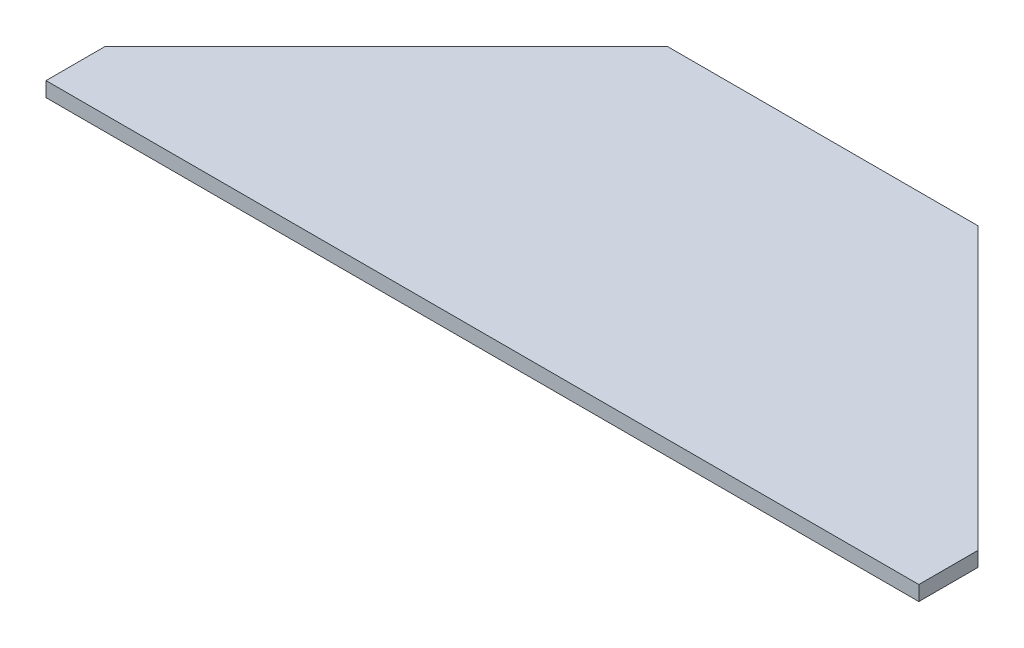
ISO-10303-21;
HEADER;
FILE_DESCRIPTION(('STEP AP214'),'2;1');
FILE_NAME('part.step','',(''),(''),'','','');
FILE_SCHEMA(('AUTOMOTIVE_DESIGN { 1 0 10303 214 1 1 1 1 }'));
ENDSEC;
DATA;
#1=APPLICATION_CONTEXT('core data for automotive mechanical design processes');
#2=APPLICATION_PROTOCOL_DEFINITION('international standard','automotive_design',2000,#1);
#3=PRODUCT_CONTEXT('',#1,'mechanical');
#4=PRODUCT('Part','Part','',(#3));
#5=PRODUCT_RELATED_PRODUCT_CATEGORY('part','',(#4));
#6=PRODUCT_DEFINITION_FORMATION('','',#4);
#7=PRODUCT_DEFINITION_CONTEXT('part definition',#1,'design');
#8=PRODUCT_DEFINITION('design','',#6,#7);
#9=PRODUCT_DEFINITION_SHAPE('','',#8);
#10=(LENGTH_UNIT() NAMED_UNIT(*) SI_UNIT(.MILLI.,.METRE.));
#11=(NAMED_UNIT(*) PLANE_ANGLE_UNIT() SI_UNIT($,.RADIAN.));
#12=(NAMED_UNIT(*) SI_UNIT($,.STERADIAN.) SOLID_ANGLE_UNIT());
#13=UNCERTAINTY_MEASURE_WITH_UNIT(LENGTH_MEASURE(1.E-05),#10,'distance_accuracy_value','');
#14=(GEOMETRIC_REPRESENTATION_CONTEXT(3) GLOBAL_UNCERTAINTY_ASSIGNED_CONTEXT((#13)) GLOBAL_UNIT_ASSIGNED_CONTEXT((#10,
#11,#12)) REPRESENTATION_CONTEXT('',''));
#15=CARTESIAN_POINT('',(0.,0.,0.));
#16=DIRECTION('',(0.,0.,1.));
#17=DIRECTION('',(1.,0.,0.));
#18=AXIS2_PLACEMENT_3D('',#15,#16,#17);
#19=CARTESIAN_POINT('',(0.,6.35,-25.4));
#20=DIRECTION('',(1.,0.,0.));
#21=DIRECTION('',(0.,0.,-1.));
#22=AXIS2_PLACEMENT_3D('',#19,#20,#21);
#23=PLANE('',#22);
#24=DIRECTION('',(0.,0.,1.));
#25=VECTOR('',#24,1.);
#26=CARTESIAN_POINT('',(0.,0.,-25.4));
#27=LINE('',#26,#25);
#28=CARTESIAN_POINT('',(0.,0.,-25.4));
#29=VERTEX_POINT('',#28);
#30=CARTESIAN_POINT('',(0.,0.,0.));
#31=VERTEX_POINT('',#30);
#32=EDGE_CURVE('E125',#29,#31,#27,.T.);
#33=ORIENTED_EDGE('',*,*,#32,.T.);
#34=DIRECTION('',(0.,-1.,0.));
#35=VECTOR('',#34,1.);
#36=CARTESIAN_POINT('',(0.,6.35,0.));
#37=LINE('',#36,#35);
#38=CARTESIAN_POINT('',(0.,6.35,0.));
#39=VERTEX_POINT('',#38);
#40=EDGE_CURVE('E11',#39,#31,#37,.T.);
#41=ORIENTED_EDGE('',*,*,#40,.F.);
#42=DIRECTION('',(0.,0.,1.));
#43=VECTOR('',#42,1.);
#44=CARTESIAN_POINT('',(0.,6.35,-25.4));
#45=LINE('',#44,#43);
#46=CARTESIAN_POINT('',(0.,6.35,-25.4));
#47=VERTEX_POINT('',#46);
#48=EDGE_CURVE('E135',#47,#39,#45,.T.);
#49=ORIENTED_EDGE('',*,*,#48,.F.);
#50=DIRECTION('',(0.,-1.,0.));
#51=VECTOR('',#50,1.);
#52=CARTESIAN_POINT('',(0.,6.35,-25.4));
#53=LINE('',#52,#51);
#54=EDGE_CURVE('E121',#47,#29,#53,.T.);
#55=ORIENTED_EDGE('',*,*,#54,.T.);
#56=EDGE_LOOP('',(#33,#41,#49,#55));
#57=FACE_BOUND('',#56,.T.);
#58=ADVANCED_FACE('F41',(#57),#23,.F.);
#59=CARTESIAN_POINT('',(0.,6.35,0.));
#60=DIRECTION('',(0.,0.,-1.));
#61=DIRECTION('',(-1.,0.,0.));
#62=AXIS2_PLACEMENT_3D('',#59,#60,#61);
#63=PLANE('',#62);
#64=DIRECTION('',(1.,0.,0.));
#65=VECTOR('',#64,1.);
#66=CARTESIAN_POINT('',(0.,0.,0.));
#67=LINE('',#66,#65);
#68=CARTESIAN_POINT('',(374.65,0.,0.));
#69=VERTEX_POINT('',#68);
#70=EDGE_CURVE('E128',#31,#69,#67,.T.);
#71=ORIENTED_EDGE('',*,*,#70,.T.);
#72=DIRECTION('',(0.,-1.,0.));
#73=VECTOR('',#72,1.);
#74=CARTESIAN_POINT('',(374.65,6.35,0.));
#75=LINE('',#74,#73);
#76=CARTESIAN_POINT('',(374.65,6.35,0.));
#77=VERTEX_POINT('',#76);
#78=EDGE_CURVE('E49',#77,#69,#75,.T.);
#79=ORIENTED_EDGE('',*,*,#78,.F.);
#80=DIRECTION('',(1.,0.,0.));
#81=VECTOR('',#80,1.);
#82=CARTESIAN_POINT('',(0.,6.35,0.));
#83=LINE('',#82,#81);
#84=EDGE_CURVE('E94',#39,#77,#83,.T.);
#85=ORIENTED_EDGE('',*,*,#84,.F.);
#86=ORIENTED_EDGE('',*,*,#40,.T.);
#87=EDGE_LOOP('',(#71,#79,#85,#86));
#88=FACE_BOUND('',#87,.T.);
#89=ADVANCED_FACE('F159',(#88),#63,.F.);
#90=CARTESIAN_POINT('',(374.65,6.35,0.));
#91=DIRECTION('',(-1.,0.,0.));
#92=DIRECTION('',(0.,0.,1.));
#93=AXIS2_PLACEMENT_3D('',#90,#91,#92);
#94=PLANE('',#93);
#95=DIRECTION('',(0.,0.,-1.));
#96=VECTOR('',#95,1.);
#97=CARTESIAN_POINT('',(374.65,0.,0.));
#98=LINE('',#97,#96);
#99=CARTESIAN_POINT('',(374.65,0.,-25.4));
#100=VERTEX_POINT('',#99);
#101=EDGE_CURVE('E130',#69,#100,#98,.T.);
#102=ORIENTED_EDGE('',*,*,#101,.T.);
#103=DIRECTION('',(0.,-1.,0.));
#104=VECTOR('',#103,1.);
#105=CARTESIAN_POINT('',(374.65,6.35,-25.4));
#106=LINE('',#105,#104);
#107=CARTESIAN_POINT('',(374.65,6.35,-25.4));
#108=VERTEX_POINT('',#107);
#109=EDGE_CURVE('E116',#108,#100,#106,.T.);
#110=ORIENTED_EDGE('',*,*,#109,.F.);
#111=DIRECTION('',(0.,0.,-1.));
#112=VECTOR('',#111,1.);
#113=CARTESIAN_POINT('',(374.65,6.35,0.));
#114=LINE('',#113,#112);
#115=EDGE_CURVE('E107',#77,#108,#114,.T.);
#116=ORIENTED_EDGE('',*,*,#115,.F.);
#117=ORIENTED_EDGE('',*,*,#78,.T.);
#118=EDGE_LOOP('',(#102,#110,#116,#117));
#119=FACE_BOUND('',#118,.T.);
#120=ADVANCED_FACE('F141',(#119),#94,.F.);
#121=CARTESIAN_POINT('',(374.65,6.35,-25.4));
#122=DIRECTION('',(-0.707106781186548,0.,0.707106781186548));
#123=DIRECTION('',(0.707106781186548,0.,0.707106781186548));
#124=AXIS2_PLACEMENT_3D('',#121,#122,#123);
#125=PLANE('',#124);
#126=DIRECTION('',(-0.707106781186547,0.,-0.707106781186547));
#127=VECTOR('',#126,1.);
#128=CARTESIAN_POINT('',(374.65,0.,-25.4));
#129=LINE('',#128,#127);
#130=CARTESIAN_POINT('',(254.,0.,-146.05));
#131=VERTEX_POINT('',#130);
#132=EDGE_CURVE('E115',#100,#131,#129,.T.);
#133=ORIENTED_EDGE('',*,*,#132,.T.);
#134=DIRECTION('',(0.,-1.,0.));
#135=VECTOR('',#134,1.);
#136=CARTESIAN_POINT('',(254.,6.35,-146.05));
#137=LINE('',#136,#135);
#138=CARTESIAN_POINT('',(254.,6.35,-146.05));
#139=VERTEX_POINT('',#138);
#140=EDGE_CURVE('E112',#139,#131,#137,.T.);
#141=ORIENTED_EDGE('',*,*,#140,.F.);
#142=DIRECTION('',(-0.707106781186547,0.,-0.707106781186547));
#143=VECTOR('',#142,1.);
#144=CARTESIAN_POINT('',(374.65,6.35,-25.4));
#145=LINE('',#144,#143);
#146=EDGE_CURVE('E101',#108,#139,#145,.T.);
#147=ORIENTED_EDGE('',*,*,#146,.F.);
#148=ORIENTED_EDGE('',*,*,#109,.T.);
#149=EDGE_LOOP('',(#133,#141,#147,#148));
#150=FACE_BOUND('',#149,.T.);
#151=ADVANCED_FACE('F113',(#150),#125,.F.);
#152=CARTESIAN_POINT('',(254.,6.35,-146.05));
#153=DIRECTION('',(0.,0.,1.));
#154=DIRECTION('',(1.,0.,0.));
#155=AXIS2_PLACEMENT_3D('',#152,#153,#154);
#156=PLANE('',#155);
#157=DIRECTION('',(-1.,0.,0.));
#158=VECTOR('',#157,1.);
#159=CARTESIAN_POINT('',(254.,0.,-146.05));
#160=LINE('',#159,#158);
#161=CARTESIAN_POINT('',(120.65,0.,-146.05));
#162=VERTEX_POINT('',#161);
#163=EDGE_CURVE('E80',#131,#162,#160,.T.);
#164=ORIENTED_EDGE('',*,*,#163,.T.);
#165=DIRECTION('',(0.,-1.,0.));
#166=VECTOR('',#165,1.);
#167=CARTESIAN_POINT('',(120.65,6.35,-146.05));
#168=LINE('',#167,#166);
#169=CARTESIAN_POINT('',(120.65,6.35,-146.05));
#170=VERTEX_POINT('',#169);
#171=EDGE_CURVE('E117',#170,#162,#168,.T.);
#172=ORIENTED_EDGE('',*,*,#171,.F.);
#173=DIRECTION('',(-1.,0.,0.));
#174=VECTOR('',#173,1.);
#175=CARTESIAN_POINT('',(254.,6.35,-146.05));
#176=LINE('',#175,#174);
#177=EDGE_CURVE('E105',#139,#170,#176,.T.);
#178=ORIENTED_EDGE('',*,*,#177,.F.);
#179=ORIENTED_EDGE('',*,*,#140,.T.);
#180=EDGE_LOOP('',(#164,#172,#178,#179));
#181=FACE_BOUND('',#180,.T.);
#182=ADVANCED_FACE('F119',(#181),#156,.F.);
#183=CARTESIAN_POINT('',(120.65,6.35,-146.05));
#184=DIRECTION('',(0.707106781186548,0.,0.707106781186548));
#185=DIRECTION('',(0.707106781186548,0.,-0.707106781186548));
#186=AXIS2_PLACEMENT_3D('',#183,#184,#185);
#187=PLANE('',#186);
#188=DIRECTION('',(-0.707106781186547,0.,0.707106781186547));
#189=VECTOR('',#188,1.);
#190=CARTESIAN_POINT('',(120.65,0.,-146.05));
#191=LINE('',#190,#189);
#192=EDGE_CURVE('E86',#162,#29,#191,.T.);
#193=ORIENTED_EDGE('',*,*,#192,.T.);
#194=ORIENTED_EDGE('',*,*,#54,.F.);
#195=DIRECTION('',(-0.707106781186547,0.,0.707106781186547));
#196=VECTOR('',#195,1.);
#197=CARTESIAN_POINT('',(120.65,6.35,-146.05));
#198=LINE('',#197,#196);
#199=EDGE_CURVE('E57',#170,#47,#198,.T.);
#200=ORIENTED_EDGE('',*,*,#199,.F.);
#201=ORIENTED_EDGE('',*,*,#171,.T.);
#202=EDGE_LOOP('',(#193,#194,#200,#201));
#203=FACE_BOUND('',#202,.T.);
#204=ADVANCED_FACE('F148',(#203),#187,.F.);
#205=CARTESIAN_POINT('',(0.,6.35,0.));
#206=DIRECTION('',(0.,1.,0.));
#207=DIRECTION('',(0.,0.,1.));
#208=AXIS2_PLACEMENT_3D('',#205,#206,#207);
#209=PLANE('',#208);
#210=ORIENTED_EDGE('',*,*,#48,.T.);
#211=ORIENTED_EDGE('',*,*,#84,.T.);
#212=ORIENTED_EDGE('',*,*,#115,.T.);
#213=ORIENTED_EDGE('',*,*,#146,.T.);
#214=ORIENTED_EDGE('',*,*,#177,.T.);
#215=ORIENTED_EDGE('',*,*,#199,.T.);
#216=EDGE_LOOP('',(#210,#211,#212,#213,#214,#215));
#217=FACE_BOUND('',#216,.T.);
#218=ADVANCED_FACE('F103',(#217),#209,.T.);
#219=CARTESIAN_POINT('',(0.,0.,0.));
#220=DIRECTION('',(0.,1.,0.));
#221=DIRECTION('',(0.,0.,1.));
#222=AXIS2_PLACEMENT_3D('',#219,#220,#221);
#223=PLANE('',#222);
#224=ORIENTED_EDGE('',*,*,#32,.F.);
#225=ORIENTED_EDGE('',*,*,#192,.F.);
#226=ORIENTED_EDGE('',*,*,#163,.F.);
#227=ORIENTED_EDGE('',*,*,#132,.F.);
#228=ORIENTED_EDGE('',*,*,#101,.F.);
#229=ORIENTED_EDGE('',*,*,#70,.F.);
#230=EDGE_LOOP('',(#224,#225,#226,#227,#228,#229));
#231=FACE_BOUND('',#230,.T.);
#232=ADVANCED_FACE('F144',(#231),#223,.F.);
#233=CLOSED_SHELL('',(#58,#89,#120,#151,#182,#204,#218,#232));
#234=MANIFOLD_SOLID_BREP('B2',#233);
#235=ADVANCED_BREP_SHAPE_REPRESENTATION('',(#18,#234),#14);
#236=SHAPE_DEFINITION_REPRESENTATION(#9,#235);
ENDSEC;
END-ISO-10303-21;
